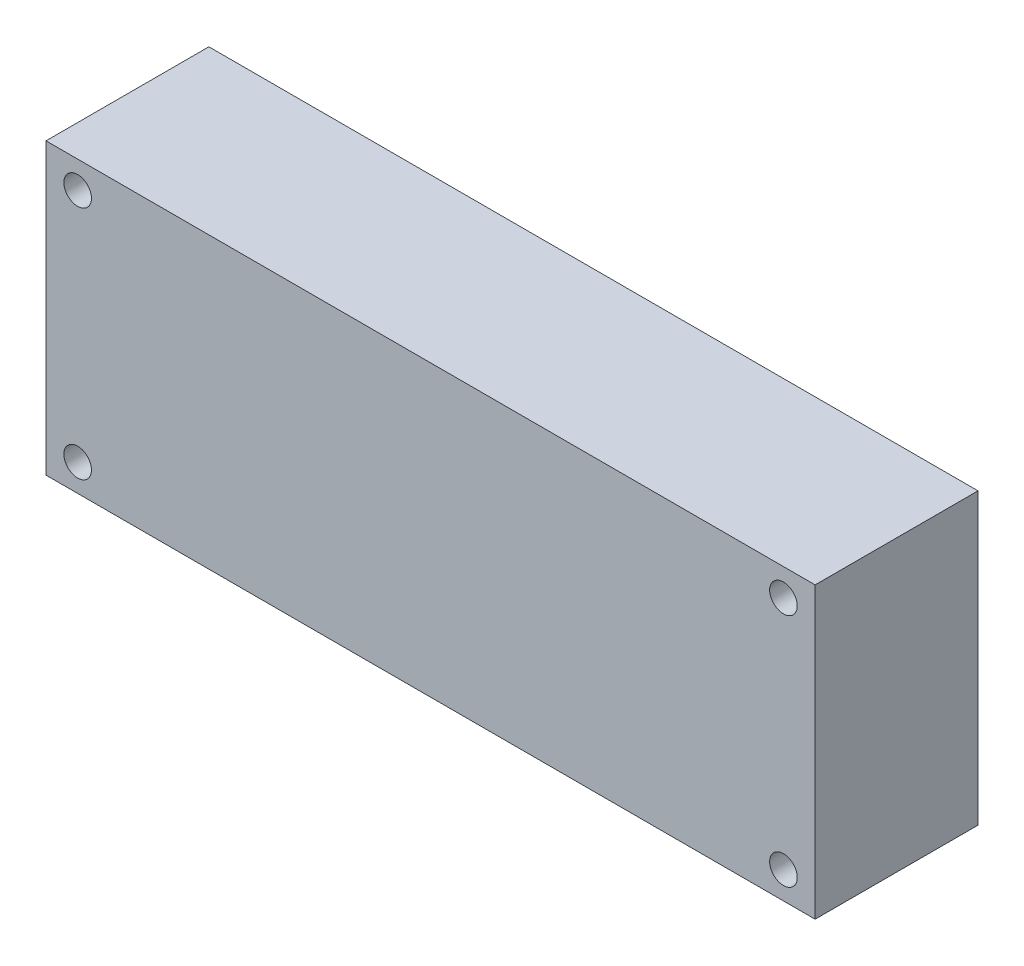
ISO-10303-21;
HEADER;
FILE_DESCRIPTION(('STEP AP214'),'2;1');
FILE_NAME('part.step','',(''),(''),'','','');
FILE_SCHEMA(('AUTOMOTIVE_DESIGN { 1 0 10303 214 1 1 1 1 }'));
ENDSEC;
DATA;
#1=APPLICATION_CONTEXT('core data for automotive mechanical design processes');
#2=APPLICATION_PROTOCOL_DEFINITION('international standard','automotive_design',2000,#1);
#3=PRODUCT_CONTEXT('',#1,'mechanical');
#4=PRODUCT('Part','Part','',(#3));
#5=PRODUCT_RELATED_PRODUCT_CATEGORY('part','',(#4));
#6=PRODUCT_DEFINITION_FORMATION('','',#4);
#7=PRODUCT_DEFINITION_CONTEXT('part definition',#1,'design');
#8=PRODUCT_DEFINITION('design','',#6,#7);
#9=PRODUCT_DEFINITION_SHAPE('','',#8);
#10=(LENGTH_UNIT() NAMED_UNIT(*) SI_UNIT(.MILLI.,.METRE.));
#11=(NAMED_UNIT(*) PLANE_ANGLE_UNIT() SI_UNIT($,.RADIAN.));
#12=(NAMED_UNIT(*) SI_UNIT($,.STERADIAN.) SOLID_ANGLE_UNIT());
#13=UNCERTAINTY_MEASURE_WITH_UNIT(LENGTH_MEASURE(1.E-05),#10,'distance_accuracy_value','');
#14=(GEOMETRIC_REPRESENTATION_CONTEXT(3) GLOBAL_UNCERTAINTY_ASSIGNED_CONTEXT((#13)) GLOBAL_UNIT_ASSIGNED_CONTEXT((#10,
#11,#12)) REPRESENTATION_CONTEXT('',''));
#15=CARTESIAN_POINT('',(0.,0.,0.));
#16=DIRECTION('',(0.,0.,1.));
#17=DIRECTION('',(1.,0.,0.));
#18=AXIS2_PLACEMENT_3D('',#15,#16,#17);
#19=CARTESIAN_POINT('',(42.5,-16.,18.));
#20=DIRECTION('',(-1.,0.,0.));
#21=DIRECTION('',(0.,0.,1.));
#22=AXIS2_PLACEMENT_3D('',#19,#20,#21);
#23=PLANE('',#22);
#24=DIRECTION('',(0.,1.,0.));
#25=VECTOR('',#24,1.);
#26=CARTESIAN_POINT('',(42.5,-16.,0.));
#27=LINE('',#26,#25);
#28=CARTESIAN_POINT('',(42.5,-16.,0.));
#29=VERTEX_POINT('',#28);
#30=CARTESIAN_POINT('',(42.5,16.,0.));
#31=VERTEX_POINT('',#30);
#32=EDGE_CURVE('E98',#29,#31,#27,.T.);
#33=ORIENTED_EDGE('',*,*,#32,.T.);
#34=DIRECTION('',(0.,0.,-1.));
#35=VECTOR('',#34,1.);
#36=CARTESIAN_POINT('',(42.5,16.,18.));
#37=LINE('',#36,#35);
#38=CARTESIAN_POINT('',(42.5,16.,18.));
#39=VERTEX_POINT('',#38);
#40=EDGE_CURVE('E11',#39,#31,#37,.T.);
#41=ORIENTED_EDGE('',*,*,#40,.F.);
#42=DIRECTION('',(0.,1.,0.));
#43=VECTOR('',#42,1.);
#44=CARTESIAN_POINT('',(42.5,-16.,18.));
#45=LINE('',#44,#43);
#46=CARTESIAN_POINT('',(42.5,-16.,18.));
#47=VERTEX_POINT('',#46);
#48=EDGE_CURVE('E86',#47,#39,#45,.T.);
#49=ORIENTED_EDGE('',*,*,#48,.F.);
#50=DIRECTION('',(0.,0.,-1.));
#51=VECTOR('',#50,1.);
#52=CARTESIAN_POINT('',(42.5,-16.,18.));
#53=LINE('',#52,#51);
#54=EDGE_CURVE('E94',#47,#29,#53,.T.);
#55=ORIENTED_EDGE('',*,*,#54,.T.);
#56=EDGE_LOOP('',(#33,#41,#49,#55));
#57=FACE_BOUND('',#56,.T.);
#58=ADVANCED_FACE('F35',(#57),#23,.F.);
#59=CARTESIAN_POINT('',(-42.5,16.,18.));
#60=DIRECTION('',(0.,-1.,0.));
#61=DIRECTION('',(0.,0.,-1.));
#62=AXIS2_PLACEMENT_3D('',#59,#60,#61);
#63=PLANE('',#62);
#64=DIRECTION('',(-1.,0.,0.));
#65=VECTOR('',#64,1.);
#66=CARTESIAN_POINT('',(-42.5,16.,0.));
#67=LINE('',#66,#65);
#68=CARTESIAN_POINT('',(-42.5,16.,0.));
#69=VERTEX_POINT('',#68);
#70=EDGE_CURVE('E90',#31,#69,#67,.T.);
#71=ORIENTED_EDGE('',*,*,#70,.T.);
#72=DIRECTION('',(0.,0.,-1.));
#73=VECTOR('',#72,1.);
#74=CARTESIAN_POINT('',(-42.5,16.,18.));
#75=LINE('',#74,#73);
#76=CARTESIAN_POINT('',(-42.5,16.,18.));
#77=VERTEX_POINT('',#76);
#78=EDGE_CURVE('E43',#77,#69,#75,.T.);
#79=ORIENTED_EDGE('',*,*,#78,.F.);
#80=DIRECTION('',(-1.,0.,0.));
#81=VECTOR('',#80,1.);
#82=CARTESIAN_POINT('',(-42.5,16.,18.));
#83=LINE('',#82,#81);
#84=EDGE_CURVE('E81',#39,#77,#83,.T.);
#85=ORIENTED_EDGE('',*,*,#84,.F.);
#86=ORIENTED_EDGE('',*,*,#40,.T.);
#87=EDGE_LOOP('',(#71,#79,#85,#86));
#88=FACE_BOUND('',#87,.T.);
#89=ADVANCED_FACE('F89',(#88),#63,.F.);
#90=CARTESIAN_POINT('',(-42.5,-16.,18.));
#91=DIRECTION('',(1.,0.,0.));
#92=DIRECTION('',(0.,0.,-1.));
#93=AXIS2_PLACEMENT_3D('',#90,#91,#92);
#94=PLANE('',#93);
#95=DIRECTION('',(0.,-1.,0.));
#96=VECTOR('',#95,1.);
#97=CARTESIAN_POINT('',(-42.5,-16.,0.));
#98=LINE('',#97,#96);
#99=CARTESIAN_POINT('',(-42.5,-16.,0.));
#100=VERTEX_POINT('',#99);
#101=EDGE_CURVE('E68',#69,#100,#98,.T.);
#102=ORIENTED_EDGE('',*,*,#101,.T.);
#103=DIRECTION('',(0.,0.,-1.));
#104=VECTOR('',#103,1.);
#105=CARTESIAN_POINT('',(-42.5,-16.,18.));
#106=LINE('',#105,#104);
#107=CARTESIAN_POINT('',(-42.5,-16.,18.));
#108=VERTEX_POINT('',#107);
#109=EDGE_CURVE('E91',#108,#100,#106,.T.);
#110=ORIENTED_EDGE('',*,*,#109,.F.);
#111=DIRECTION('',(0.,-1.,0.));
#112=VECTOR('',#111,1.);
#113=CARTESIAN_POINT('',(-42.5,-16.,18.));
#114=LINE('',#113,#112);
#115=EDGE_CURVE('E84',#77,#108,#114,.T.);
#116=ORIENTED_EDGE('',*,*,#115,.F.);
#117=ORIENTED_EDGE('',*,*,#78,.T.);
#118=EDGE_LOOP('',(#102,#110,#116,#117));
#119=FACE_BOUND('',#118,.T.);
#120=ADVANCED_FACE('F92',(#119),#94,.F.);
#121=CARTESIAN_POINT('',(-42.5,-16.,18.));
#122=DIRECTION('',(0.,1.,0.));
#123=DIRECTION('',(0.,0.,1.));
#124=AXIS2_PLACEMENT_3D('',#121,#122,#123);
#125=PLANE('',#124);
#126=DIRECTION('',(1.,0.,0.));
#127=VECTOR('',#126,1.);
#128=CARTESIAN_POINT('',(-42.5,-16.,0.));
#129=LINE('',#128,#127);
#130=EDGE_CURVE('E74',#100,#29,#129,.T.);
#131=ORIENTED_EDGE('',*,*,#130,.T.);
#132=ORIENTED_EDGE('',*,*,#54,.F.);
#133=DIRECTION('',(1.,0.,0.));
#134=VECTOR('',#133,1.);
#135=CARTESIAN_POINT('',(-42.5,-16.,18.));
#136=LINE('',#135,#134);
#137=EDGE_CURVE('E51',#108,#47,#136,.T.);
#138=ORIENTED_EDGE('',*,*,#137,.F.);
#139=ORIENTED_EDGE('',*,*,#109,.T.);
#140=EDGE_LOOP('',(#131,#132,#138,#139));
#141=FACE_BOUND('',#140,.T.);
#142=ADVANCED_FACE('F106',(#141),#125,.F.);
#143=CARTESIAN_POINT('',(0.,0.,18.));
#144=DIRECTION('',(0.,0.,-1.));
#145=DIRECTION('',(-1.,0.,0.));
#146=AXIS2_PLACEMENT_3D('',#143,#144,#145);
#147=PLANE('',#146);
#148=CARTESIAN_POINT('',(-39.,13.,18.));
#149=DIRECTION('',(0.,0.,-1.));
#150=DIRECTION('',(-1.,0.,0.));
#151=AXIS2_PLACEMENT_3D('',#148,#149,#150);
#152=CIRCLE('',#151,1.525);
#153=CARTESIAN_POINT('',(-40.525,13.,18.));
#154=VERTEX_POINT('',#153);
#155=EDGE_CURVE('E101',#154,#154,#152,.T.);
#156=ORIENTED_EDGE('',*,*,#155,.T.);
#157=EDGE_LOOP('',(#156));
#158=FACE_BOUND('',#157,.T.);
#159=CARTESIAN_POINT('',(-39.,-13.,18.));
#160=DIRECTION('',(0.,0.,-1.));
#161=DIRECTION('',(-1.,0.,0.));
#162=AXIS2_PLACEMENT_3D('',#159,#160,#161);
#163=CIRCLE('',#162,1.525);
#164=CARTESIAN_POINT('',(-40.525,-13.,18.));
#165=VERTEX_POINT('',#164);
#166=EDGE_CURVE('E114',#165,#165,#163,.T.);
#167=ORIENTED_EDGE('',*,*,#166,.T.);
#168=EDGE_LOOP('',(#167));
#169=FACE_BOUND('',#168,.T.);
#170=CARTESIAN_POINT('',(39.,-13.,18.));
#171=DIRECTION('',(0.,0.,-1.));
#172=DIRECTION('',(-1.,0.,0.));
#173=AXIS2_PLACEMENT_3D('',#170,#171,#172);
#174=CIRCLE('',#173,1.525);
#175=CARTESIAN_POINT('',(37.475,-13.,18.));
#176=VERTEX_POINT('',#175);
#177=EDGE_CURVE('E117',#176,#176,#174,.T.);
#178=ORIENTED_EDGE('',*,*,#177,.T.);
#179=EDGE_LOOP('',(#178));
#180=FACE_BOUND('',#179,.T.);
#181=CARTESIAN_POINT('',(39.,13.,18.));
#182=DIRECTION('',(0.,0.,-1.));
#183=DIRECTION('',(-1.,0.,0.));
#184=AXIS2_PLACEMENT_3D('',#181,#182,#183);
#185=CIRCLE('',#184,1.525);
#186=CARTESIAN_POINT('',(37.475,13.,18.));
#187=VERTEX_POINT('',#186);
#188=EDGE_CURVE('E120',#187,#187,#185,.T.);
#189=ORIENTED_EDGE('',*,*,#188,.T.);
#190=EDGE_LOOP('',(#189));
#191=FACE_BOUND('',#190,.T.);
#192=ORIENTED_EDGE('',*,*,#48,.T.);
#193=ORIENTED_EDGE('',*,*,#84,.T.);
#194=ORIENTED_EDGE('',*,*,#115,.T.);
#195=ORIENTED_EDGE('',*,*,#137,.T.);
#196=EDGE_LOOP('',(#192,#193,#194,#195));
#197=FACE_BOUND('',#196,.T.);
#198=ADVANCED_FACE('F82',(#158,#169,#180,#191,#197),#147,.F.);
#199=CARTESIAN_POINT('',(0.,0.,0.));
#200=DIRECTION('',(0.,0.,-1.));
#201=DIRECTION('',(-1.,0.,0.));
#202=AXIS2_PLACEMENT_3D('',#199,#200,#201);
#203=PLANE('',#202);
#204=CARTESIAN_POINT('',(-39.,13.,0.));
#205=DIRECTION('',(0.,0.,1.));
#206=DIRECTION('',(1.,0.,0.));
#207=AXIS2_PLACEMENT_3D('',#204,#205,#206);
#208=CIRCLE('',#207,1.525);
#209=CARTESIAN_POINT('',(-37.475,13.,0.));
#210=VERTEX_POINT('',#209);
#211=EDGE_CURVE('E127',#210,#210,#208,.T.);
#212=ORIENTED_EDGE('',*,*,#211,.T.);
#213=EDGE_LOOP('',(#212));
#214=FACE_BOUND('',#213,.T.);
#215=CARTESIAN_POINT('',(-39.,-13.,0.));
#216=DIRECTION('',(0.,0.,1.));
#217=DIRECTION('',(1.,0.,0.));
#218=AXIS2_PLACEMENT_3D('',#215,#216,#217);
#219=CIRCLE('',#218,1.525);
#220=CARTESIAN_POINT('',(-37.475,-13.,0.));
#221=VERTEX_POINT('',#220);
#222=EDGE_CURVE('E130',#221,#221,#219,.T.);
#223=ORIENTED_EDGE('',*,*,#222,.T.);
#224=EDGE_LOOP('',(#223));
#225=FACE_BOUND('',#224,.T.);
#226=CARTESIAN_POINT('',(39.,-13.,0.));
#227=DIRECTION('',(0.,0.,1.));
#228=DIRECTION('',(1.,0.,0.));
#229=AXIS2_PLACEMENT_3D('',#226,#227,#228);
#230=CIRCLE('',#229,1.525);
#231=CARTESIAN_POINT('',(40.525,-13.,0.));
#232=VERTEX_POINT('',#231);
#233=EDGE_CURVE('E126',#232,#232,#230,.T.);
#234=ORIENTED_EDGE('',*,*,#233,.T.);
#235=EDGE_LOOP('',(#234));
#236=FACE_BOUND('',#235,.T.);
#237=CARTESIAN_POINT('',(39.,13.,0.));
#238=DIRECTION('',(0.,0.,1.));
#239=DIRECTION('',(1.,0.,0.));
#240=AXIS2_PLACEMENT_3D('',#237,#238,#239);
#241=CIRCLE('',#240,1.525);
#242=CARTESIAN_POINT('',(40.525,13.,0.));
#243=VERTEX_POINT('',#242);
#244=EDGE_CURVE('E123',#243,#243,#241,.T.);
#245=ORIENTED_EDGE('',*,*,#244,.T.);
#246=EDGE_LOOP('',(#245));
#247=FACE_BOUND('',#246,.T.);
#248=ORIENTED_EDGE('',*,*,#32,.F.);
#249=ORIENTED_EDGE('',*,*,#130,.F.);
#250=ORIENTED_EDGE('',*,*,#101,.F.);
#251=ORIENTED_EDGE('',*,*,#70,.F.);
#252=EDGE_LOOP('',(#248,#249,#250,#251));
#253=FACE_BOUND('',#252,.T.);
#254=ADVANCED_FACE('F109',(#214,#225,#236,#247,#253),#203,.T.);
#255=CARTESIAN_POINT('',(39.,13.,0.));
#256=DIRECTION('',(0.,0.,1.));
#257=DIRECTION('',(1.,0.,0.));
#258=AXIS2_PLACEMENT_3D('',#255,#256,#257);
#259=CYLINDRICAL_SURFACE('',#258,1.525);
#260=ORIENTED_EDGE('',*,*,#244,.F.);
#261=EDGE_LOOP('',(#260));
#262=FACE_BOUND('',#261,.T.);
#263=ORIENTED_EDGE('',*,*,#188,.F.);
#264=EDGE_LOOP('',(#263));
#265=FACE_BOUND('',#264,.T.);
#266=ADVANCED_FACE('F142',(#262,#265),#259,.F.);
#267=CARTESIAN_POINT('',(39.,-13.,0.));
#268=DIRECTION('',(0.,0.,1.));
#269=DIRECTION('',(1.,0.,0.));
#270=AXIS2_PLACEMENT_3D('',#267,#268,#269);
#271=CYLINDRICAL_SURFACE('',#270,1.525);
#272=ORIENTED_EDGE('',*,*,#233,.F.);
#273=EDGE_LOOP('',(#272));
#274=FACE_BOUND('',#273,.T.);
#275=ORIENTED_EDGE('',*,*,#177,.F.);
#276=EDGE_LOOP('',(#275));
#277=FACE_BOUND('',#276,.T.);
#278=ADVANCED_FACE('F138',(#274,#277),#271,.F.);
#279=CARTESIAN_POINT('',(-39.,-13.,0.));
#280=DIRECTION('',(0.,0.,1.));
#281=DIRECTION('',(1.,0.,0.));
#282=AXIS2_PLACEMENT_3D('',#279,#280,#281);
#283=CYLINDRICAL_SURFACE('',#282,1.525);
#284=ORIENTED_EDGE('',*,*,#222,.F.);
#285=EDGE_LOOP('',(#284));
#286=FACE_BOUND('',#285,.T.);
#287=ORIENTED_EDGE('',*,*,#166,.F.);
#288=EDGE_LOOP('',(#287));
#289=FACE_BOUND('',#288,.T.);
#290=ADVANCED_FACE('F141',(#286,#289),#283,.F.);
#291=CARTESIAN_POINT('',(-39.,13.,0.));
#292=DIRECTION('',(0.,0.,1.));
#293=DIRECTION('',(1.,0.,0.));
#294=AXIS2_PLACEMENT_3D('',#291,#292,#293);
#295=CYLINDRICAL_SURFACE('',#294,1.525);
#296=ORIENTED_EDGE('',*,*,#211,.F.);
#297=EDGE_LOOP('',(#296));
#298=FACE_BOUND('',#297,.T.);
#299=ORIENTED_EDGE('',*,*,#155,.F.);
#300=EDGE_LOOP('',(#299));
#301=FACE_BOUND('',#300,.T.);
#302=ADVANCED_FACE('F203',(#298,#301),#295,.F.);
#303=CLOSED_SHELL('',(#58,#89,#120,#142,#198,#254,#266,#278,#290,#302));
#304=MANIFOLD_SOLID_BREP('B2',#303);
#305=ADVANCED_BREP_SHAPE_REPRESENTATION('',(#18,#304),#14);
#306=SHAPE_DEFINITION_REPRESENTATION(#9,#305);
ENDSEC;
END-ISO-10303-21;
